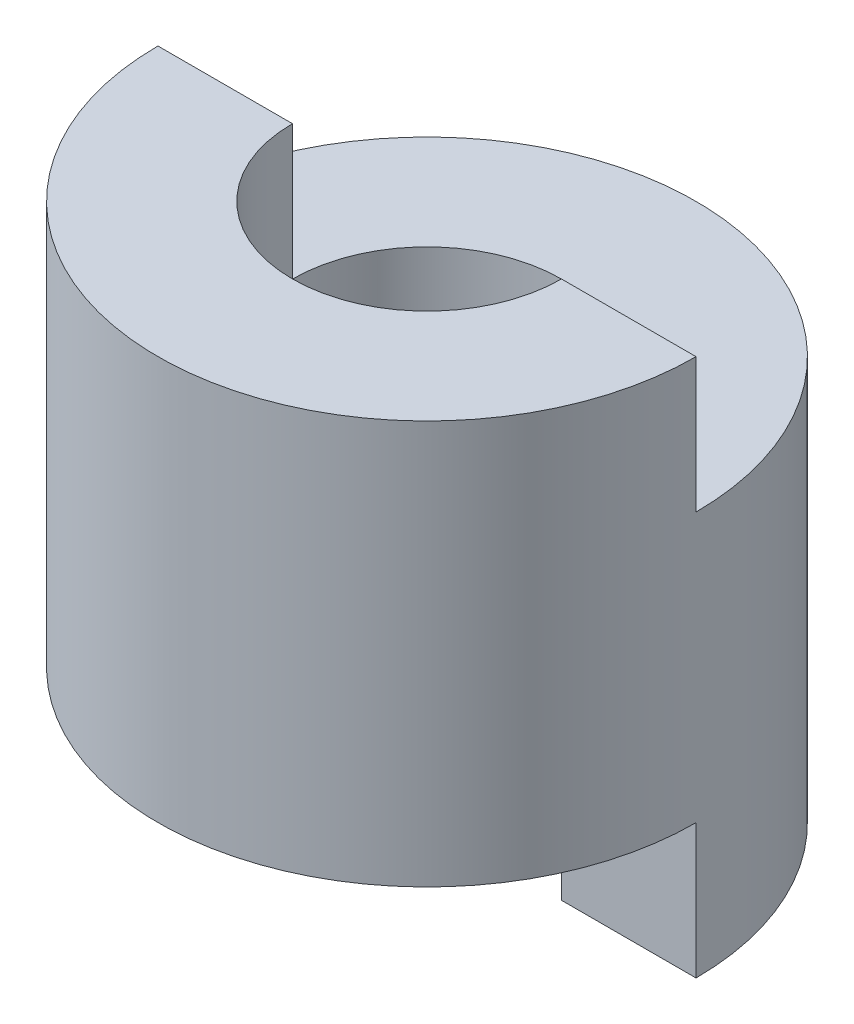
ISO-10303-21;
HEADER;
FILE_DESCRIPTION(('STEP AP214'),'2;1');
FILE_NAME('part.step','',(''),(''),'','','');
FILE_SCHEMA(('AUTOMOTIVE_DESIGN { 1 0 10303 214 1 1 1 1 }'));
ENDSEC;
DATA;
#1=APPLICATION_CONTEXT('core data for automotive mechanical design processes');
#2=APPLICATION_PROTOCOL_DEFINITION('international standard','automotive_design',2000,#1);
#3=PRODUCT_CONTEXT('',#1,'mechanical');
#4=PRODUCT('Part','Part','',(#3));
#5=PRODUCT_RELATED_PRODUCT_CATEGORY('part','',(#4));
#6=PRODUCT_DEFINITION_FORMATION('','',#4);
#7=PRODUCT_DEFINITION_CONTEXT('part definition',#1,'design');
#8=PRODUCT_DEFINITION('design','',#6,#7);
#9=PRODUCT_DEFINITION_SHAPE('','',#8);
#10=(LENGTH_UNIT() NAMED_UNIT(*) SI_UNIT(.MILLI.,.METRE.));
#11=(NAMED_UNIT(*) PLANE_ANGLE_UNIT() SI_UNIT($,.RADIAN.));
#12=(NAMED_UNIT(*) SI_UNIT($,.STERADIAN.) SOLID_ANGLE_UNIT());
#13=UNCERTAINTY_MEASURE_WITH_UNIT(LENGTH_MEASURE(1.E-05),#10,'distance_accuracy_value','');
#14=(GEOMETRIC_REPRESENTATION_CONTEXT(3) GLOBAL_UNCERTAINTY_ASSIGNED_CONTEXT((#13)) GLOBAL_UNIT_ASSIGNED_CONTEXT((#10,
#11,#12)) REPRESENTATION_CONTEXT('',''));
#15=CARTESIAN_POINT('',(0.,0.,0.));
#16=DIRECTION('',(0.,0.,1.));
#17=DIRECTION('',(1.,0.,0.));
#18=AXIS2_PLACEMENT_3D('',#15,#16,#17);
#19=CARTESIAN_POINT('',(0.,20.,0.));
#20=DIRECTION('',(0.,1.,0.));
#21=DIRECTION('',(0.,0.,1.));
#22=AXIS2_PLACEMENT_3D('',#19,#20,#21);
#23=PLANE('',#22);
#24=DIRECTION('',(1.,0.,0.));
#25=VECTOR('',#24,1.);
#26=CARTESIAN_POINT('',(5.,20.,0.));
#27=LINE('',#26,#25);
#28=CARTESIAN_POINT('',(5.,20.,0.));
#29=VERTEX_POINT('',#28);
#30=CARTESIAN_POINT('',(10.,20.,0.));
#31=VERTEX_POINT('',#30);
#32=EDGE_CURVE('E126',#29,#31,#27,.T.);
#33=ORIENTED_EDGE('',*,*,#32,.F.);
#34=CARTESIAN_POINT('',(0.,20.,0.));
#35=DIRECTION('',(0.,1.,0.));
#36=DIRECTION('',(0.,0.,1.));
#37=AXIS2_PLACEMENT_3D('',#34,#35,#36);
#38=CIRCLE('',#37,5.);
#39=CARTESIAN_POINT('',(-5.,20.,0.));
#40=VERTEX_POINT('',#39);
#41=EDGE_CURVE('E141',#40,#29,#38,.T.);
#42=ORIENTED_EDGE('',*,*,#41,.F.);
#43=DIRECTION('',(1.,0.,0.));
#44=VECTOR('',#43,1.);
#45=CARTESIAN_POINT('',(-10.,20.,0.));
#46=LINE('',#45,#44);
#47=CARTESIAN_POINT('',(-10.,20.,0.));
#48=VERTEX_POINT('',#47);
#49=EDGE_CURVE('E134',#48,#40,#46,.T.);
#50=ORIENTED_EDGE('',*,*,#49,.F.);
#51=CARTESIAN_POINT('',(0.,20.,0.));
#52=DIRECTION('',(0.,-1.,0.));
#53=DIRECTION('',(0.,0.,-1.));
#54=AXIS2_PLACEMENT_3D('',#51,#52,#53);
#55=CIRCLE('',#54,10.);
#56=EDGE_CURVE('E11',#31,#48,#55,.T.);
#57=ORIENTED_EDGE('',*,*,#56,.F.);
#58=EDGE_LOOP('',(#33,#42,#50,#57));
#59=FACE_BOUND('',#58,.T.);
#60=ADVANCED_FACE('F33',(#59),#23,.T.);
#61=CARTESIAN_POINT('',(0.,0.,0.));
#62=DIRECTION('',(0.,-1.,0.));
#63=DIRECTION('',(0.,0.,-1.));
#64=AXIS2_PLACEMENT_3D('',#61,#62,#63);
#65=CYLINDRICAL_SURFACE('',#64,10.);
#66=DIRECTION('',(0.,-1.,0.));
#67=VECTOR('',#66,1.);
#68=CARTESIAN_POINT('',(10.,5.,0.));
#69=LINE('',#68,#67);
#70=CARTESIAN_POINT('',(10.,5.,0.));
#71=VERTEX_POINT('',#70);
#72=CARTESIAN_POINT('',(10.,0.,0.));
#73=VERTEX_POINT('',#72);
#74=EDGE_CURVE('E136',#71,#73,#69,.T.);
#75=ORIENTED_EDGE('',*,*,#74,.T.);
#76=CARTESIAN_POINT('',(0.,0.,0.));
#77=DIRECTION('',(0.,-1.,0.));
#78=DIRECTION('',(0.,0.,-1.));
#79=AXIS2_PLACEMENT_3D('',#76,#77,#78);
#80=CIRCLE('',#79,10.);
#81=CARTESIAN_POINT('',(-10.,0.,0.));
#82=VERTEX_POINT('',#81);
#83=EDGE_CURVE('E40',#82,#73,#80,.T.);
#84=ORIENTED_EDGE('',*,*,#83,.F.);
#85=DIRECTION('',(0.,-1.,0.));
#86=VECTOR('',#85,1.);
#87=CARTESIAN_POINT('',(-10.,5.,0.));
#88=LINE('',#87,#86);
#89=CARTESIAN_POINT('',(-10.,5.,0.));
#90=VERTEX_POINT('',#89);
#91=EDGE_CURVE('E97',#90,#82,#88,.T.);
#92=ORIENTED_EDGE('',*,*,#91,.F.);
#93=CARTESIAN_POINT('',(0.,5.,0.));
#94=DIRECTION('',(0.,-1.,0.));
#95=DIRECTION('',(0.,0.,1.));
#96=AXIS2_PLACEMENT_3D('',#93,#94,#95);
#97=CIRCLE('',#96,10.);
#98=EDGE_CURVE('E103',#71,#90,#97,.T.);
#99=ORIENTED_EDGE('',*,*,#98,.F.);
#100=EDGE_LOOP('',(#75,#84,#92,#99));
#101=FACE_BOUND('',#100,.T.);
#102=DIRECTION('',(0.,1.,0.));
#103=VECTOR('',#102,1.);
#104=CARTESIAN_POINT('',(10.,15.,0.));
#105=LINE('',#104,#103);
#106=CARTESIAN_POINT('',(10.,15.,0.));
#107=VERTEX_POINT('',#106);
#108=EDGE_CURVE('E138',#107,#31,#105,.T.);
#109=ORIENTED_EDGE('',*,*,#108,.T.);
#110=ORIENTED_EDGE('',*,*,#56,.T.);
#111=DIRECTION('',(0.,1.,0.));
#112=VECTOR('',#111,1.);
#113=CARTESIAN_POINT('',(-10.,15.,0.));
#114=LINE('',#113,#112);
#115=CARTESIAN_POINT('',(-10.,15.,0.));
#116=VERTEX_POINT('',#115);
#117=EDGE_CURVE('E133',#116,#48,#114,.T.);
#118=ORIENTED_EDGE('',*,*,#117,.F.);
#119=CARTESIAN_POINT('',(0.,15.,0.));
#120=DIRECTION('',(0.,1.,0.));
#121=DIRECTION('',(0.,0.,-1.));
#122=AXIS2_PLACEMENT_3D('',#119,#120,#121);
#123=CIRCLE('',#122,10.);
#124=EDGE_CURVE('E124',#107,#116,#123,.T.);
#125=ORIENTED_EDGE('',*,*,#124,.F.);
#126=EDGE_LOOP('',(#109,#110,#118,#125));
#127=FACE_BOUND('',#126,.T.);
#128=ADVANCED_FACE('F115',(#101,#127),#65,.T.);
#129=CARTESIAN_POINT('',(0.,0.,0.));
#130=DIRECTION('',(0.,-1.,0.));
#131=DIRECTION('',(0.,0.,-1.));
#132=AXIS2_PLACEMENT_3D('',#129,#130,#131);
#133=PLANE('',#132);
#134=DIRECTION('',(1.,0.,0.));
#135=VECTOR('',#134,1.);
#136=CARTESIAN_POINT('',(5.,0.,0.));
#137=LINE('',#136,#135);
#138=CARTESIAN_POINT('',(5.,0.,0.));
#139=VERTEX_POINT('',#138);
#140=EDGE_CURVE('E112',#139,#73,#137,.T.);
#141=ORIENTED_EDGE('',*,*,#140,.F.);
#142=CARTESIAN_POINT('',(0.,0.,0.));
#143=DIRECTION('',(0.,1.,0.));
#144=DIRECTION('',(0.,0.,1.));
#145=AXIS2_PLACEMENT_3D('',#142,#143,#144);
#146=CIRCLE('',#145,5.);
#147=CARTESIAN_POINT('',(-5.,0.,0.));
#148=VERTEX_POINT('',#147);
#149=EDGE_CURVE('E148',#139,#148,#146,.T.);
#150=ORIENTED_EDGE('',*,*,#149,.T.);
#151=DIRECTION('',(1.,0.,0.));
#152=VECTOR('',#151,1.);
#153=CARTESIAN_POINT('',(-10.,0.,0.));
#154=LINE('',#153,#152);
#155=EDGE_CURVE('E156',#82,#148,#154,.T.);
#156=ORIENTED_EDGE('',*,*,#155,.F.);
#157=ORIENTED_EDGE('',*,*,#83,.T.);
#158=EDGE_LOOP('',(#141,#150,#156,#157));
#159=FACE_BOUND('',#158,.T.);
#160=ADVANCED_FACE('F154',(#159),#133,.T.);
#161=CARTESIAN_POINT('',(0.,0.,0.));
#162=DIRECTION('',(0.,1.,0.));
#163=DIRECTION('',(0.,0.,1.));
#164=AXIS2_PLACEMENT_3D('',#161,#162,#163);
#165=CYLINDRICAL_SURFACE('',#164,5.);
#166=ORIENTED_EDGE('',*,*,#149,.F.);
#167=DIRECTION('',(0.,-1.,0.));
#168=VECTOR('',#167,1.);
#169=CARTESIAN_POINT('',(5.,5.,0.));
#170=LINE('',#169,#168);
#171=CARTESIAN_POINT('',(5.,5.,0.));
#172=VERTEX_POINT('',#171);
#173=EDGE_CURVE('E119',#172,#139,#170,.T.);
#174=ORIENTED_EDGE('',*,*,#173,.F.);
#175=CARTESIAN_POINT('',(0.,5.,0.));
#176=DIRECTION('',(0.,1.,0.));
#177=DIRECTION('',(0.,0.,1.));
#178=AXIS2_PLACEMENT_3D('',#175,#176,#177);
#179=CIRCLE('',#178,5.);
#180=CARTESIAN_POINT('',(-5.,5.,0.));
#181=VERTEX_POINT('',#180);
#182=EDGE_CURVE('E102',#181,#172,#179,.T.);
#183=ORIENTED_EDGE('',*,*,#182,.F.);
#184=DIRECTION('',(0.,-1.,0.));
#185=VECTOR('',#184,1.);
#186=CARTESIAN_POINT('',(-5.,5.,0.));
#187=LINE('',#186,#185);
#188=EDGE_CURVE('E100',#181,#148,#187,.T.);
#189=ORIENTED_EDGE('',*,*,#188,.T.);
#190=EDGE_LOOP('',(#166,#174,#183,#189));
#191=FACE_BOUND('',#190,.T.);
#192=ORIENTED_EDGE('',*,*,#41,.T.);
#193=DIRECTION('',(0.,1.,0.));
#194=VECTOR('',#193,1.);
#195=CARTESIAN_POINT('',(5.,15.,0.));
#196=LINE('',#195,#194);
#197=CARTESIAN_POINT('',(5.,15.,0.));
#198=VERTEX_POINT('',#197);
#199=EDGE_CURVE('E142',#198,#29,#196,.T.);
#200=ORIENTED_EDGE('',*,*,#199,.F.);
#201=CARTESIAN_POINT('',(0.,15.,0.));
#202=DIRECTION('',(0.,-1.,0.));
#203=DIRECTION('',(0.,0.,-1.));
#204=AXIS2_PLACEMENT_3D('',#201,#202,#203);
#205=CIRCLE('',#204,5.);
#206=CARTESIAN_POINT('',(-5.,15.,0.));
#207=VERTEX_POINT('',#206);
#208=EDGE_CURVE('E128',#207,#198,#205,.T.);
#209=ORIENTED_EDGE('',*,*,#208,.F.);
#210=DIRECTION('',(0.,1.,0.));
#211=VECTOR('',#210,1.);
#212=CARTESIAN_POINT('',(-5.,15.,0.));
#213=LINE('',#212,#211);
#214=EDGE_CURVE('E144',#207,#40,#213,.T.);
#215=ORIENTED_EDGE('',*,*,#214,.T.);
#216=EDGE_LOOP('',(#192,#200,#209,#215));
#217=FACE_BOUND('',#216,.T.);
#218=ADVANCED_FACE('F165',(#191,#217),#165,.F.);
#219=CARTESIAN_POINT('',(5.,15.,0.));
#220=DIRECTION('',(0.,0.,1.));
#221=DIRECTION('',(1.,0.,0.));
#222=AXIS2_PLACEMENT_3D('',#219,#220,#221);
#223=PLANE('',#222);
#224=ORIENTED_EDGE('',*,*,#32,.T.);
#225=ORIENTED_EDGE('',*,*,#108,.F.);
#226=DIRECTION('',(1.,0.,0.));
#227=VECTOR('',#226,1.);
#228=CARTESIAN_POINT('',(5.,15.,0.));
#229=LINE('',#228,#227);
#230=EDGE_CURVE('E130',#198,#107,#229,.T.);
#231=ORIENTED_EDGE('',*,*,#230,.F.);
#232=ORIENTED_EDGE('',*,*,#199,.T.);
#233=EDGE_LOOP('',(#224,#225,#231,#232));
#234=FACE_BOUND('',#233,.T.);
#235=ADVANCED_FACE('F168',(#234),#223,.F.);
#236=CARTESIAN_POINT('',(-10.,15.,0.));
#237=DIRECTION('',(0.,0.,1.));
#238=DIRECTION('',(1.,0.,0.));
#239=AXIS2_PLACEMENT_3D('',#236,#237,#238);
#240=PLANE('',#239);
#241=ORIENTED_EDGE('',*,*,#49,.T.);
#242=ORIENTED_EDGE('',*,*,#214,.F.);
#243=DIRECTION('',(1.,0.,0.));
#244=VECTOR('',#243,1.);
#245=CARTESIAN_POINT('',(-10.,15.,0.));
#246=LINE('',#245,#244);
#247=EDGE_CURVE('E55',#116,#207,#246,.T.);
#248=ORIENTED_EDGE('',*,*,#247,.F.);
#249=ORIENTED_EDGE('',*,*,#117,.T.);
#250=EDGE_LOOP('',(#241,#242,#248,#249));
#251=FACE_BOUND('',#250,.T.);
#252=ADVANCED_FACE('F183',(#251),#240,.F.);
#253=CARTESIAN_POINT('',(0.,15.,0.));
#254=DIRECTION('',(0.,-1.,0.));
#255=DIRECTION('',(0.,0.,-1.));
#256=AXIS2_PLACEMENT_3D('',#253,#254,#255);
#257=PLANE('',#256);
#258=ORIENTED_EDGE('',*,*,#124,.T.);
#259=ORIENTED_EDGE('',*,*,#247,.T.);
#260=ORIENTED_EDGE('',*,*,#208,.T.);
#261=ORIENTED_EDGE('',*,*,#230,.T.);
#262=EDGE_LOOP('',(#258,#259,#260,#261));
#263=FACE_BOUND('',#262,.T.);
#264=ADVANCED_FACE('F181',(#263),#257,.F.);
#265=CARTESIAN_POINT('',(5.,5.,0.));
#266=DIRECTION('',(0.,0.,-1.));
#267=DIRECTION('',(-1.,0.,0.));
#268=AXIS2_PLACEMENT_3D('',#265,#266,#267);
#269=PLANE('',#268);
#270=ORIENTED_EDGE('',*,*,#140,.T.);
#271=ORIENTED_EDGE('',*,*,#74,.F.);
#272=DIRECTION('',(1.,0.,0.));
#273=VECTOR('',#272,1.);
#274=CARTESIAN_POINT('',(5.,5.,0.));
#275=LINE('',#274,#273);
#276=EDGE_CURVE('E109',#172,#71,#275,.T.);
#277=ORIENTED_EDGE('',*,*,#276,.F.);
#278=ORIENTED_EDGE('',*,*,#173,.T.);
#279=EDGE_LOOP('',(#270,#271,#277,#278));
#280=FACE_BOUND('',#279,.T.);
#281=ADVANCED_FACE('F163',(#280),#269,.F.);
#282=CARTESIAN_POINT('',(-10.,5.,0.));
#283=DIRECTION('',(0.,0.,-1.));
#284=DIRECTION('',(-1.,0.,0.));
#285=AXIS2_PLACEMENT_3D('',#282,#283,#284);
#286=PLANE('',#285);
#287=ORIENTED_EDGE('',*,*,#155,.T.);
#288=ORIENTED_EDGE('',*,*,#188,.F.);
#289=DIRECTION('',(1.,0.,0.));
#290=VECTOR('',#289,1.);
#291=CARTESIAN_POINT('',(-10.,5.,0.));
#292=LINE('',#291,#290);
#293=EDGE_CURVE('E47',#90,#181,#292,.T.);
#294=ORIENTED_EDGE('',*,*,#293,.F.);
#295=ORIENTED_EDGE('',*,*,#91,.T.);
#296=EDGE_LOOP('',(#287,#288,#294,#295));
#297=FACE_BOUND('',#296,.T.);
#298=ADVANCED_FACE('F95',(#297),#286,.F.);
#299=CARTESIAN_POINT('',(0.,5.,0.));
#300=DIRECTION('',(0.,1.,0.));
#301=DIRECTION('',(0.,0.,1.));
#302=AXIS2_PLACEMENT_3D('',#299,#300,#301);
#303=PLANE('',#302);
#304=ORIENTED_EDGE('',*,*,#98,.T.);
#305=ORIENTED_EDGE('',*,*,#293,.T.);
#306=ORIENTED_EDGE('',*,*,#182,.T.);
#307=ORIENTED_EDGE('',*,*,#276,.T.);
#308=EDGE_LOOP('',(#304,#305,#306,#307));
#309=FACE_BOUND('',#308,.T.);
#310=ADVANCED_FACE('F107',(#309),#303,.F.);
#311=CLOSED_SHELL('',(#60,#128,#160,#218,#235,#252,#264,#281,#298,#310));
#312=MANIFOLD_SOLID_BREP('B2',#311);
#313=ADVANCED_BREP_SHAPE_REPRESENTATION('',(#18,#312),#14);
#314=SHAPE_DEFINITION_REPRESENTATION(#9,#313);
ENDSEC;
END-ISO-10303-21;
